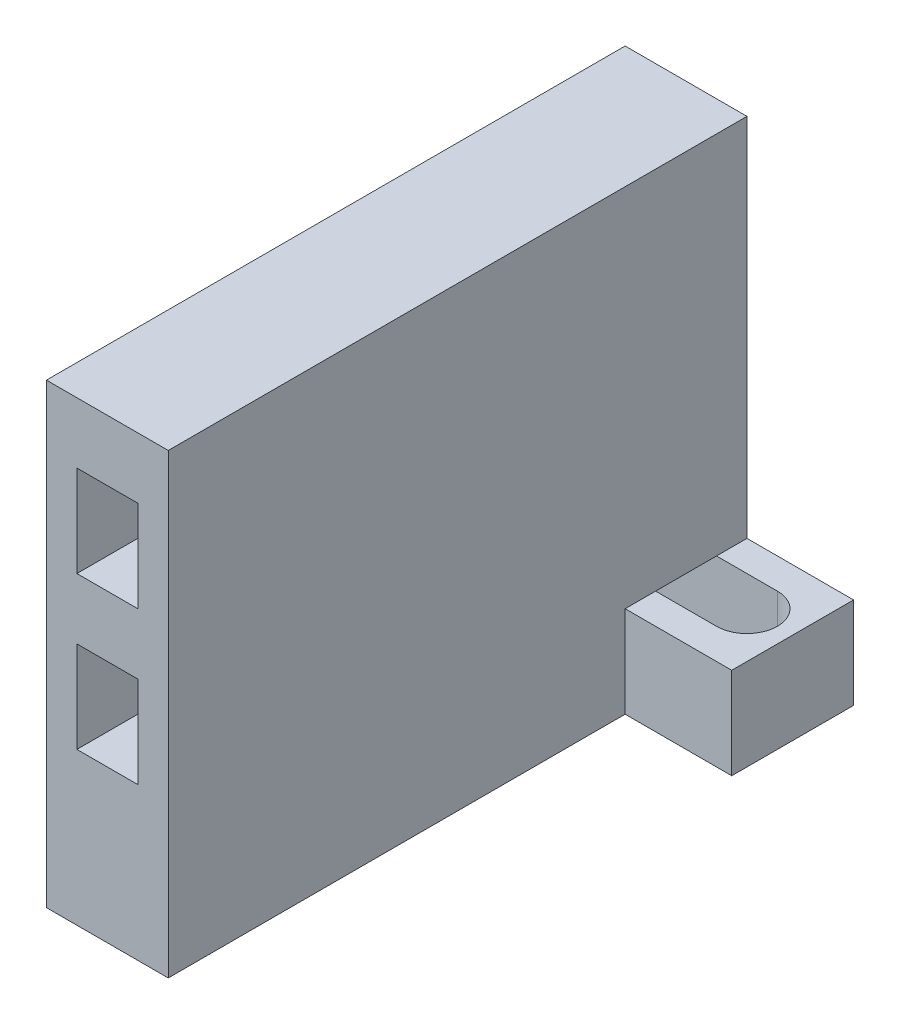
ISO-10303-21;
HEADER;
FILE_DESCRIPTION(('STEP AP214'),'2;1');
FILE_NAME('part.step','',(''),(''),'','','');
FILE_SCHEMA(('AUTOMOTIVE_DESIGN { 1 0 10303 214 1 1 1 1 }'));
ENDSEC;
DATA;
#1=APPLICATION_CONTEXT('core data for automotive mechanical design processes');
#2=APPLICATION_PROTOCOL_DEFINITION('international standard','automotive_design',2000,#1);
#3=PRODUCT_CONTEXT('',#1,'mechanical');
#4=PRODUCT('Part','Part','',(#3));
#5=PRODUCT_RELATED_PRODUCT_CATEGORY('part','',(#4));
#6=PRODUCT_DEFINITION_FORMATION('','',#4);
#7=PRODUCT_DEFINITION_CONTEXT('part definition',#1,'design');
#8=PRODUCT_DEFINITION('design','',#6,#7);
#9=PRODUCT_DEFINITION_SHAPE('','',#8);
#10=(LENGTH_UNIT() NAMED_UNIT(*) SI_UNIT(.MILLI.,.METRE.));
#11=(NAMED_UNIT(*) PLANE_ANGLE_UNIT() SI_UNIT($,.RADIAN.));
#12=(NAMED_UNIT(*) SI_UNIT($,.STERADIAN.) SOLID_ANGLE_UNIT());
#13=UNCERTAINTY_MEASURE_WITH_UNIT(LENGTH_MEASURE(1.E-05),#10,'distance_accuracy_value','');
#14=(GEOMETRIC_REPRESENTATION_CONTEXT(3) GLOBAL_UNCERTAINTY_ASSIGNED_CONTEXT((#13)) GLOBAL_UNIT_ASSIGNED_CONTEXT((#10,
#11,#12)) REPRESENTATION_CONTEXT('',''));
#15=CARTESIAN_POINT('',(0.,0.,0.));
#16=DIRECTION('',(0.,0.,1.));
#17=DIRECTION('',(1.,0.,0.));
#18=AXIS2_PLACEMENT_3D('',#15,#16,#17);
#19=CARTESIAN_POINT('',(0.,0.,8.));
#20=DIRECTION('',(0.,0.,1.));
#21=DIRECTION('',(1.,0.,0.));
#22=AXIS2_PLACEMENT_3D('',#19,#20,#21);
#23=PLANE('',#22);
#24=DIRECTION('',(-1.,0.,0.));
#25=VECTOR('',#24,1.);
#26=CARTESIAN_POINT('',(0.,5.99999999999999,8.));
#27=LINE('',#26,#25);
#28=CARTESIAN_POINT('',(15.,6.,8.));
#29=VERTEX_POINT('',#28);
#30=CARTESIAN_POINT('',(8.,6.,8.));
#31=VERTEX_POINT('',#30);
#32=EDGE_CURVE('E298',#29,#31,#27,.T.);
#33=ORIENTED_EDGE('',*,*,#32,.T.);
#34=DIRECTION('',(0.,-1.,0.));
#35=VECTOR('',#34,1.);
#36=CARTESIAN_POINT('',(8.,0.,8.));
#37=LINE('',#36,#35);
#38=CARTESIAN_POINT('',(8.,0.,8.));
#39=VERTEX_POINT('',#38);
#40=EDGE_CURVE('E12',#31,#39,#37,.T.);
#41=ORIENTED_EDGE('',*,*,#40,.T.);
#42=DIRECTION('',(1.,0.,0.));
#43=VECTOR('',#42,1.);
#44=CARTESIAN_POINT('',(0.,0.,8.));
#45=LINE('',#44,#43);
#46=CARTESIAN_POINT('',(15.,0.,8.));
#47=VERTEX_POINT('',#46);
#48=EDGE_CURVE('E301',#39,#47,#45,.T.);
#49=ORIENTED_EDGE('',*,*,#48,.T.);
#50=DIRECTION('',(0.,1.,0.));
#51=VECTOR('',#50,1.);
#52=CARTESIAN_POINT('',(15.,0.,8.));
#53=LINE('',#52,#51);
#54=EDGE_CURVE('E304',#47,#29,#53,.T.);
#55=ORIENTED_EDGE('',*,*,#54,.T.);
#56=EDGE_LOOP('',(#33,#41,#49,#55));
#57=FACE_BOUND('',#56,.T.);
#58=ADVANCED_FACE('F85',(#57),#23,.T.);
#59=CARTESIAN_POINT('',(0.,5.99999999999999,8.));
#60=DIRECTION('',(0.,-1.,0.));
#61=DIRECTION('',(1.,0.,0.));
#62=AXIS2_PLACEMENT_3D('',#59,#60,#61);
#63=PLANE('',#62);
#64=DIRECTION('',(0.,0.,-1.));
#65=VECTOR('',#64,1.);
#66=CARTESIAN_POINT('',(8.,5.99999999999999,8.));
#67=LINE('',#66,#65);
#68=CARTESIAN_POINT('',(8.,5.99999999999999,2.00000000000002));
#69=VERTEX_POINT('',#68);
#70=CARTESIAN_POINT('',(8.,5.99999999999999,0.));
#71=VERTEX_POINT('',#70);
#72=EDGE_CURVE('E358',#69,#71,#67,.T.);
#73=ORIENTED_EDGE('',*,*,#72,.F.);
#74=DIRECTION('',(-1.,0.,0.));
#75=VECTOR('',#74,1.);
#76=CARTESIAN_POINT('',(0.,5.99999999999998,2.00000000000002));
#77=LINE('',#76,#75);
#78=CARTESIAN_POINT('',(12.,6.,2.00000000000002));
#79=VERTEX_POINT('',#78);
#80=EDGE_CURVE('E102',#79,#69,#77,.T.);
#81=ORIENTED_EDGE('',*,*,#80,.F.);
#82=CARTESIAN_POINT('',(12.,6.,4.00000000000002));
#83=DIRECTION('',(0.,-1.,0.));
#84=DIRECTION('',(1.,0.,0.));
#85=AXIS2_PLACEMENT_3D('',#82,#83,#84);
#86=CIRCLE('',#85,2.);
#87=CARTESIAN_POINT('',(12.,6.,6.00000000000005));
#88=VERTEX_POINT('',#87);
#89=EDGE_CURVE('E257',#88,#79,#86,.F.);
#90=ORIENTED_EDGE('',*,*,#89,.F.);
#91=DIRECTION('',(-1.,0.,0.));
#92=VECTOR('',#91,1.);
#93=CARTESIAN_POINT('',(0.,5.99999999999998,6.00000000000004));
#94=LINE('',#93,#92);
#95=CARTESIAN_POINT('',(8.,5.99999999999999,6.00000000000005));
#96=VERTEX_POINT('',#95);
#97=EDGE_CURVE('E233',#88,#96,#94,.T.);
#98=ORIENTED_EDGE('',*,*,#97,.T.);
#99=EDGE_CURVE('E94',#31,#96,#67,.T.);
#100=ORIENTED_EDGE('',*,*,#99,.F.);
#101=ORIENTED_EDGE('',*,*,#32,.F.);
#102=DIRECTION('',(0.,0.,-1.));
#103=VECTOR('',#102,1.);
#104=CARTESIAN_POINT('',(15.,6.,8.));
#105=LINE('',#104,#103);
#106=CARTESIAN_POINT('',(15.,6.,0.));
#107=VERTEX_POINT('',#106);
#108=EDGE_CURVE('E342',#29,#107,#105,.T.);
#109=ORIENTED_EDGE('',*,*,#108,.T.);
#110=DIRECTION('',(-1.,0.,0.));
#111=VECTOR('',#110,1.);
#112=CARTESIAN_POINT('',(0.,5.99999999999999,0.));
#113=LINE('',#112,#111);
#114=EDGE_CURVE('E330',#107,#71,#113,.T.);
#115=ORIENTED_EDGE('',*,*,#114,.T.);
#116=EDGE_LOOP('',(#73,#81,#90,#98,#100,#101,#109,#115));
#117=FACE_BOUND('',#116,.T.);
#118=ADVANCED_FACE('F402',(#117),#63,.F.);
#119=CARTESIAN_POINT('',(8.,0.,8.));
#120=DIRECTION('',(-1.,0.,0.));
#121=DIRECTION('',(0.,-1.,0.));
#122=AXIS2_PLACEMENT_3D('',#119,#120,#121);
#123=PLANE('',#122);
#124=DIRECTION('',(0.,1.,0.));
#125=VECTOR('',#124,1.);
#126=CARTESIAN_POINT('',(8.,0.,0.));
#127=LINE('',#126,#125);
#128=CARTESIAN_POINT('',(8.,30.,0.));
#129=VERTEX_POINT('',#128);
#130=EDGE_CURVE('E333',#71,#129,#127,.T.);
#131=ORIENTED_EDGE('',*,*,#130,.T.);
#132=DIRECTION('',(0.,0.,-1.));
#133=VECTOR('',#132,1.);
#134=CARTESIAN_POINT('',(8.,30.,8.));
#135=LINE('',#134,#133);
#136=CARTESIAN_POINT('',(8.,30.,38.));
#137=VERTEX_POINT('',#136);
#138=EDGE_CURVE('E355',#137,#129,#135,.T.);
#139=ORIENTED_EDGE('',*,*,#138,.F.);
#140=DIRECTION('',(0.,-1.,0.));
#141=VECTOR('',#140,1.);
#142=CARTESIAN_POINT('',(8.,0.,38.));
#143=LINE('',#142,#141);
#144=CARTESIAN_POINT('',(8.,0.,38.));
#145=VERTEX_POINT('',#144);
#146=EDGE_CURVE('E283',#137,#145,#143,.T.);
#147=ORIENTED_EDGE('',*,*,#146,.T.);
#148=DIRECTION('',(0.,0.,-1.));
#149=VECTOR('',#148,1.);
#150=CARTESIAN_POINT('',(8.,0.,38.));
#151=LINE('',#150,#149);
#152=EDGE_CURVE('E294',#145,#39,#151,.T.);
#153=ORIENTED_EDGE('',*,*,#152,.T.);
#154=ORIENTED_EDGE('',*,*,#40,.F.);
#155=ORIENTED_EDGE('',*,*,#99,.T.);
#156=EDGE_CURVE('E361',#96,#69,#67,.T.);
#157=ORIENTED_EDGE('',*,*,#156,.T.);
#158=ORIENTED_EDGE('',*,*,#72,.T.);
#159=EDGE_LOOP('',(#131,#139,#147,#153,#154,#155,#157,#158));
#160=FACE_BOUND('',#159,.T.);
#161=ADVANCED_FACE('F408',(#160),#123,.F.);
#162=CARTESIAN_POINT('',(0.,30.,8.));
#163=DIRECTION('',(0.,-1.,0.));
#164=DIRECTION('',(0.,0.,-1.));
#165=AXIS2_PLACEMENT_3D('',#162,#163,#164);
#166=PLANE('',#165);
#167=DIRECTION('',(-1.,0.,0.));
#168=VECTOR('',#167,1.);
#169=CARTESIAN_POINT('',(0.,30.,0.));
#170=LINE('',#169,#168);
#171=CARTESIAN_POINT('',(0.,30.,0.));
#172=VERTEX_POINT('',#171);
#173=EDGE_CURVE('E335',#129,#172,#170,.T.);
#174=ORIENTED_EDGE('',*,*,#173,.T.);
#175=DIRECTION('',(0.,0.,-1.));
#176=VECTOR('',#175,1.);
#177=CARTESIAN_POINT('',(0.,30.,8.));
#178=LINE('',#177,#176);
#179=CARTESIAN_POINT('',(0.,30.,38.));
#180=VERTEX_POINT('',#179);
#181=EDGE_CURVE('E352',#180,#172,#178,.T.);
#182=ORIENTED_EDGE('',*,*,#181,.F.);
#183=DIRECTION('',(1.,0.,0.));
#184=VECTOR('',#183,1.);
#185=CARTESIAN_POINT('',(0.,30.,38.));
#186=LINE('',#185,#184);
#187=EDGE_CURVE('E292',#180,#137,#186,.T.);
#188=ORIENTED_EDGE('',*,*,#187,.T.);
#189=ORIENTED_EDGE('',*,*,#138,.T.);
#190=EDGE_LOOP('',(#174,#182,#188,#189));
#191=FACE_BOUND('',#190,.T.);
#192=ADVANCED_FACE('F427',(#191),#166,.F.);
#193=CARTESIAN_POINT('',(0.,0.,8.));
#194=DIRECTION('',(1.,0.,0.));
#195=DIRECTION('',(0.,0.,-1.));
#196=AXIS2_PLACEMENT_3D('',#193,#194,#195);
#197=PLANE('',#196);
#198=DIRECTION('',(0.,-1.,0.));
#199=VECTOR('',#198,1.);
#200=CARTESIAN_POINT('',(0.,0.,0.));
#201=LINE('',#200,#199);
#202=CARTESIAN_POINT('',(0.,0.,0.));
#203=VERTEX_POINT('',#202);
#204=EDGE_CURVE('E337',#172,#203,#201,.T.);
#205=ORIENTED_EDGE('',*,*,#204,.T.);
#206=DIRECTION('',(0.,0.,-1.));
#207=VECTOR('',#206,1.);
#208=CARTESIAN_POINT('',(0.,0.,8.));
#209=LINE('',#208,#207);
#210=CARTESIAN_POINT('',(0.,0.,38.));
#211=VERTEX_POINT('',#210);
#212=EDGE_CURVE('E349',#211,#203,#209,.T.);
#213=ORIENTED_EDGE('',*,*,#212,.F.);
#214=DIRECTION('',(0.,1.,0.));
#215=VECTOR('',#214,1.);
#216=CARTESIAN_POINT('',(0.,0.,38.));
#217=LINE('',#216,#215);
#218=EDGE_CURVE('E289',#211,#180,#217,.T.);
#219=ORIENTED_EDGE('',*,*,#218,.T.);
#220=ORIENTED_EDGE('',*,*,#181,.T.);
#221=EDGE_LOOP('',(#205,#213,#219,#220));
#222=FACE_BOUND('',#221,.T.);
#223=ADVANCED_FACE('F424',(#222),#197,.F.);
#224=CARTESIAN_POINT('',(0.,0.,8.));
#225=DIRECTION('',(0.,1.,0.));
#226=DIRECTION('',(0.,0.,1.));
#227=AXIS2_PLACEMENT_3D('',#224,#225,#226);
#228=PLANE('',#227);
#229=CARTESIAN_POINT('',(12.,0.,4.00000000000002));
#230=DIRECTION('',(0.,-1.,0.));
#231=DIRECTION('',(0.,0.,-1.00000000000001));
#232=AXIS2_PLACEMENT_3D('',#229,#230,#231);
#233=CIRCLE('',#232,2.);
#234=CARTESIAN_POINT('',(12.,0.,2.00000000000002));
#235=VERTEX_POINT('',#234);
#236=CARTESIAN_POINT('',(12.,0.,6.00000000000005));
#237=VERTEX_POINT('',#236);
#238=EDGE_CURVE('E240',#235,#237,#233,.T.);
#239=ORIENTED_EDGE('',*,*,#238,.F.);
#240=DIRECTION('',(1.,0.,0.));
#241=VECTOR('',#240,1.);
#242=CARTESIAN_POINT('',(0.,0.,2.00000000000002));
#243=LINE('',#242,#241);
#244=CARTESIAN_POINT('',(4.,0.,2.00000000000002));
#245=VERTEX_POINT('',#244);
#246=EDGE_CURVE('E108',#245,#235,#243,.T.);
#247=ORIENTED_EDGE('',*,*,#246,.F.);
#248=CARTESIAN_POINT('',(4.,0.,4.00000000000002));
#249=DIRECTION('',(0.,-1.,0.));
#250=DIRECTION('',(0.,0.,-1.00000000000001));
#251=AXIS2_PLACEMENT_3D('',#248,#249,#250);
#252=CIRCLE('',#251,2.);
#253=CARTESIAN_POINT('',(4.,0.,6.00000000000005));
#254=VERTEX_POINT('',#253);
#255=EDGE_CURVE('E247',#254,#245,#252,.T.);
#256=ORIENTED_EDGE('',*,*,#255,.F.);
#257=DIRECTION('',(1.,0.,0.));
#258=VECTOR('',#257,1.);
#259=CARTESIAN_POINT('',(0.,0.,6.00000000000004));
#260=LINE('',#259,#258);
#261=EDGE_CURVE('E229',#254,#237,#260,.T.);
#262=ORIENTED_EDGE('',*,*,#261,.T.);
#263=EDGE_LOOP('',(#239,#247,#256,#262));
#264=FACE_BOUND('',#263,.T.);
#265=DIRECTION('',(1.,0.,0.));
#266=VECTOR('',#265,1.);
#267=CARTESIAN_POINT('',(0.,0.,0.));
#268=LINE('',#267,#266);
#269=CARTESIAN_POINT('',(15.,0.,0.));
#270=VERTEX_POINT('',#269);
#271=EDGE_CURVE('E339',#203,#270,#268,.T.);
#272=ORIENTED_EDGE('',*,*,#271,.T.);
#273=DIRECTION('',(0.,0.,-1.));
#274=VECTOR('',#273,1.);
#275=CARTESIAN_POINT('',(15.,0.,8.));
#276=LINE('',#275,#274);
#277=EDGE_CURVE('E345',#47,#270,#276,.T.);
#278=ORIENTED_EDGE('',*,*,#277,.F.);
#279=ORIENTED_EDGE('',*,*,#48,.F.);
#280=ORIENTED_EDGE('',*,*,#152,.F.);
#281=DIRECTION('',(-1.,0.,0.));
#282=VECTOR('',#281,1.);
#283=CARTESIAN_POINT('',(0.,0.,38.));
#284=LINE('',#283,#282);
#285=EDGE_CURVE('E286',#145,#211,#284,.T.);
#286=ORIENTED_EDGE('',*,*,#285,.T.);
#287=ORIENTED_EDGE('',*,*,#212,.T.);
#288=EDGE_LOOP('',(#272,#278,#279,#280,#286,#287));
#289=FACE_BOUND('',#288,.T.);
#290=ADVANCED_FACE('F244',(#264,#289),#228,.F.);
#291=CARTESIAN_POINT('',(2.,0.,8.));
#292=DIRECTION('',(1.,0.,0.));
#293=DIRECTION('',(0.,1.,0.));
#294=AXIS2_PLACEMENT_3D('',#291,#292,#293);
#295=PLANE('',#294);
#296=DIRECTION('',(0.,-1.,0.));
#297=VECTOR('',#296,1.);
#298=CARTESIAN_POINT('',(2.,0.,0.));
#299=LINE('',#298,#297);
#300=CARTESIAN_POINT('',(2.,16.,0.));
#301=VERTEX_POINT('',#300);
#302=CARTESIAN_POINT('',(2.,10.,0.));
#303=VERTEX_POINT('',#302);
#304=EDGE_CURVE('E318',#301,#303,#299,.T.);
#305=ORIENTED_EDGE('',*,*,#304,.F.);
#306=DIRECTION('',(0.,0.,-1.));
#307=VECTOR('',#306,1.);
#308=CARTESIAN_POINT('',(2.,16.,8.));
#309=LINE('',#308,#307);
#310=CARTESIAN_POINT('',(2.,16.,38.));
#311=VERTEX_POINT('',#310);
#312=EDGE_CURVE('E346',#311,#301,#309,.T.);
#313=ORIENTED_EDGE('',*,*,#312,.F.);
#314=DIRECTION('',(0.,1.,0.));
#315=VECTOR('',#314,1.);
#316=CARTESIAN_POINT('',(2.,0.,38.));
#317=LINE('',#316,#315);
#318=CARTESIAN_POINT('',(2.,10.,38.));
#319=VERTEX_POINT('',#318);
#320=EDGE_CURVE('E277',#319,#311,#317,.T.);
#321=ORIENTED_EDGE('',*,*,#320,.F.);
#322=DIRECTION('',(0.,0.,-1.));
#323=VECTOR('',#322,1.);
#324=CARTESIAN_POINT('',(2.,10.,8.));
#325=LINE('',#324,#323);
#326=EDGE_CURVE('E362',#319,#303,#325,.T.);
#327=ORIENTED_EDGE('',*,*,#326,.T.);
#328=EDGE_LOOP('',(#305,#313,#321,#327));
#329=FACE_BOUND('',#328,.T.);
#330=ADVANCED_FACE('F423',(#329),#295,.T.);
#331=CARTESIAN_POINT('',(0.,16.,8.));
#332=DIRECTION('',(0.,1.,0.));
#333=DIRECTION('',(0.,0.,1.));
#334=AXIS2_PLACEMENT_3D('',#331,#332,#333);
#335=PLANE('',#334);
#336=DIRECTION('',(1.,0.,0.));
#337=VECTOR('',#336,1.);
#338=CARTESIAN_POINT('',(0.,16.,0.));
#339=LINE('',#338,#337);
#340=CARTESIAN_POINT('',(6.,16.,0.));
#341=VERTEX_POINT('',#340);
#342=EDGE_CURVE('E321',#301,#341,#339,.T.);
#343=ORIENTED_EDGE('',*,*,#342,.T.);
#344=DIRECTION('',(0.,0.,-1.));
#345=VECTOR('',#344,1.);
#346=CARTESIAN_POINT('',(6.,16.,8.));
#347=LINE('',#346,#345);
#348=CARTESIAN_POINT('',(6.,16.,38.));
#349=VERTEX_POINT('',#348);
#350=EDGE_CURVE('E366',#349,#341,#347,.T.);
#351=ORIENTED_EDGE('',*,*,#350,.F.);
#352=DIRECTION('',(-1.,0.,0.));
#353=VECTOR('',#352,1.);
#354=CARTESIAN_POINT('',(0.,16.,38.));
#355=LINE('',#354,#353);
#356=EDGE_CURVE('E274',#349,#311,#355,.T.);
#357=ORIENTED_EDGE('',*,*,#356,.T.);
#358=ORIENTED_EDGE('',*,*,#312,.T.);
#359=EDGE_LOOP('',(#343,#351,#357,#358));
#360=FACE_BOUND('',#359,.T.);
#361=ADVANCED_FACE('F438',(#360),#335,.F.);
#362=CARTESIAN_POINT('',(6.,0.,8.));
#363=DIRECTION('',(1.,0.,0.));
#364=DIRECTION('',(0.,0.,-1.));
#365=AXIS2_PLACEMENT_3D('',#362,#363,#364);
#366=PLANE('',#365);
#367=DIRECTION('',(0.,-1.,0.));
#368=VECTOR('',#367,1.);
#369=CARTESIAN_POINT('',(6.,0.,0.));
#370=LINE('',#369,#368);
#371=CARTESIAN_POINT('',(6.,10.,0.));
#372=VERTEX_POINT('',#371);
#373=EDGE_CURVE('E324',#341,#372,#370,.T.);
#374=ORIENTED_EDGE('',*,*,#373,.T.);
#375=DIRECTION('',(0.,0.,-1.));
#376=VECTOR('',#375,1.);
#377=CARTESIAN_POINT('',(6.,10.,8.));
#378=LINE('',#377,#376);
#379=CARTESIAN_POINT('',(6.,10.,38.));
#380=VERTEX_POINT('',#379);
#381=EDGE_CURVE('E364',#380,#372,#378,.T.);
#382=ORIENTED_EDGE('',*,*,#381,.F.);
#383=DIRECTION('',(0.,1.,0.));
#384=VECTOR('',#383,1.);
#385=CARTESIAN_POINT('',(6.,0.,38.));
#386=LINE('',#385,#384);
#387=EDGE_CURVE('E271',#380,#349,#386,.T.);
#388=ORIENTED_EDGE('',*,*,#387,.T.);
#389=ORIENTED_EDGE('',*,*,#350,.T.);
#390=EDGE_LOOP('',(#374,#382,#388,#389));
#391=FACE_BOUND('',#390,.T.);
#392=ADVANCED_FACE('F435',(#391),#366,.F.);
#393=CARTESIAN_POINT('',(2.,0.,8.));
#394=DIRECTION('',(-1.,0.,0.));
#395=DIRECTION('',(0.,-1.,0.));
#396=AXIS2_PLACEMENT_3D('',#393,#394,#395);
#397=PLANE('',#396);
#398=DIRECTION('',(0.,1.,0.));
#399=VECTOR('',#398,1.);
#400=CARTESIAN_POINT('',(2.,0.,0.));
#401=LINE('',#400,#399);
#402=CARTESIAN_POINT('',(2.,20.,0.));
#403=VERTEX_POINT('',#402);
#404=CARTESIAN_POINT('',(2.,26.,0.));
#405=VERTEX_POINT('',#404);
#406=EDGE_CURVE('E297',#403,#405,#401,.T.);
#407=ORIENTED_EDGE('',*,*,#406,.T.);
#408=DIRECTION('',(0.,0.,-1.));
#409=VECTOR('',#408,1.);
#410=CARTESIAN_POINT('',(2.,26.,8.));
#411=LINE('',#410,#409);
#412=CARTESIAN_POINT('',(2.,26.,38.));
#413=VERTEX_POINT('',#412);
#414=EDGE_CURVE('E89',#413,#405,#411,.T.);
#415=ORIENTED_EDGE('',*,*,#414,.F.);
#416=DIRECTION('',(0.,-1.,0.));
#417=VECTOR('',#416,1.);
#418=CARTESIAN_POINT('',(2.,0.,38.));
#419=LINE('',#418,#417);
#420=CARTESIAN_POINT('',(2.,20.,38.));
#421=VERTEX_POINT('',#420);
#422=EDGE_CURVE('E262',#413,#421,#419,.T.);
#423=ORIENTED_EDGE('',*,*,#422,.T.);
#424=DIRECTION('',(0.,0.,-1.));
#425=VECTOR('',#424,1.);
#426=CARTESIAN_POINT('',(2.,20.,8.));
#427=LINE('',#426,#425);
#428=EDGE_CURVE('E306',#421,#403,#427,.T.);
#429=ORIENTED_EDGE('',*,*,#428,.T.);
#430=EDGE_LOOP('',(#407,#415,#423,#429));
#431=FACE_BOUND('',#430,.T.);
#432=ADVANCED_FACE('F87',(#431),#397,.F.);
#433=CARTESIAN_POINT('',(0.,26.,8.));
#434=DIRECTION('',(0.,1.,0.));
#435=DIRECTION('',(-1.,0.,0.));
#436=AXIS2_PLACEMENT_3D('',#433,#434,#435);
#437=PLANE('',#436);
#438=DIRECTION('',(1.,0.,0.));
#439=VECTOR('',#438,1.);
#440=CARTESIAN_POINT('',(0.,26.,0.));
#441=LINE('',#440,#439);
#442=CARTESIAN_POINT('',(6.,26.,0.));
#443=VERTEX_POINT('',#442);
#444=EDGE_CURVE('E309',#405,#443,#441,.T.);
#445=ORIENTED_EDGE('',*,*,#444,.T.);
#446=DIRECTION('',(0.,0.,-1.));
#447=VECTOR('',#446,1.);
#448=CARTESIAN_POINT('',(6.,26.,8.));
#449=LINE('',#448,#447);
#450=CARTESIAN_POINT('',(6.,26.,38.));
#451=VERTEX_POINT('',#450);
#452=EDGE_CURVE('E372',#451,#443,#449,.T.);
#453=ORIENTED_EDGE('',*,*,#452,.F.);
#454=DIRECTION('',(-1.,0.,0.));
#455=VECTOR('',#454,1.);
#456=CARTESIAN_POINT('',(0.,26.,38.));
#457=LINE('',#456,#455);
#458=EDGE_CURVE('E265',#451,#413,#457,.T.);
#459=ORIENTED_EDGE('',*,*,#458,.T.);
#460=ORIENTED_EDGE('',*,*,#414,.T.);
#461=EDGE_LOOP('',(#445,#453,#459,#460));
#462=FACE_BOUND('',#461,.T.);
#463=ADVANCED_FACE('F378',(#462),#437,.F.);
#464=CARTESIAN_POINT('',(6.00000000000002,0.,8.));
#465=DIRECTION('',(-1.,0.,0.));
#466=DIRECTION('',(0.,-1.,0.));
#467=AXIS2_PLACEMENT_3D('',#464,#465,#466);
#468=PLANE('',#467);
#469=DIRECTION('',(0.,1.,0.));
#470=VECTOR('',#469,1.);
#471=CARTESIAN_POINT('',(6.00000000000002,0.,0.));
#472=LINE('',#471,#470);
#473=CARTESIAN_POINT('',(6.,20.,0.));
#474=VERTEX_POINT('',#473);
#475=EDGE_CURVE('E312',#474,#443,#472,.T.);
#476=ORIENTED_EDGE('',*,*,#475,.F.);
#477=DIRECTION('',(0.,0.,-1.));
#478=VECTOR('',#477,1.);
#479=CARTESIAN_POINT('',(6.,20.,8.));
#480=LINE('',#479,#478);
#481=CARTESIAN_POINT('',(6.,20.,38.));
#482=VERTEX_POINT('',#481);
#483=EDGE_CURVE('E371',#482,#474,#480,.T.);
#484=ORIENTED_EDGE('',*,*,#483,.F.);
#485=DIRECTION('',(0.,-1.,0.));
#486=VECTOR('',#485,1.);
#487=CARTESIAN_POINT('',(6.00000000000002,0.,38.));
#488=LINE('',#487,#486);
#489=EDGE_CURVE('E268',#451,#482,#488,.T.);
#490=ORIENTED_EDGE('',*,*,#489,.F.);
#491=ORIENTED_EDGE('',*,*,#452,.T.);
#492=EDGE_LOOP('',(#476,#484,#490,#491));
#493=FACE_BOUND('',#492,.T.);
#494=ADVANCED_FACE('F390',(#493),#468,.T.);
#495=CARTESIAN_POINT('',(0.,10.,8.));
#496=DIRECTION('',(0.,1.,0.));
#497=DIRECTION('',(0.,0.,1.));
#498=AXIS2_PLACEMENT_3D('',#495,#496,#497);
#499=PLANE('',#498);
#500=DIRECTION('',(1.,0.,0.));
#501=VECTOR('',#500,1.);
#502=CARTESIAN_POINT('',(0.,10.,0.));
#503=LINE('',#502,#501);
#504=EDGE_CURVE('E327',#303,#372,#503,.T.);
#505=ORIENTED_EDGE('',*,*,#504,.F.);
#506=ORIENTED_EDGE('',*,*,#326,.F.);
#507=DIRECTION('',(-1.,0.,0.));
#508=VECTOR('',#507,1.);
#509=CARTESIAN_POINT('',(0.,10.,38.));
#510=LINE('',#509,#508);
#511=EDGE_CURVE('E280',#380,#319,#510,.T.);
#512=ORIENTED_EDGE('',*,*,#511,.F.);
#513=ORIENTED_EDGE('',*,*,#381,.T.);
#514=EDGE_LOOP('',(#505,#506,#512,#513));
#515=FACE_BOUND('',#514,.T.);
#516=ADVANCED_FACE('F392',(#515),#499,.T.);
#517=CARTESIAN_POINT('',(0.,20.,8.));
#518=DIRECTION('',(0.,1.,0.));
#519=DIRECTION('',(0.,0.,1.));
#520=AXIS2_PLACEMENT_3D('',#517,#518,#519);
#521=PLANE('',#520);
#522=DIRECTION('',(1.,0.,0.));
#523=VECTOR('',#522,1.);
#524=CARTESIAN_POINT('',(0.,20.,0.));
#525=LINE('',#524,#523);
#526=EDGE_CURVE('E315',#403,#474,#525,.T.);
#527=ORIENTED_EDGE('',*,*,#526,.F.);
#528=ORIENTED_EDGE('',*,*,#428,.F.);
#529=DIRECTION('',(-1.,0.,0.));
#530=VECTOR('',#529,1.);
#531=CARTESIAN_POINT('',(0.,20.,38.));
#532=LINE('',#531,#530);
#533=EDGE_CURVE('E259',#482,#421,#532,.T.);
#534=ORIENTED_EDGE('',*,*,#533,.F.);
#535=ORIENTED_EDGE('',*,*,#483,.T.);
#536=EDGE_LOOP('',(#527,#528,#534,#535));
#537=FACE_BOUND('',#536,.T.);
#538=ADVANCED_FACE('F388',(#537),#521,.T.);
#539=CARTESIAN_POINT('',(15.,0.,8.));
#540=DIRECTION('',(-1.,0.,0.));
#541=DIRECTION('',(0.,-1.,0.));
#542=AXIS2_PLACEMENT_3D('',#539,#540,#541);
#543=PLANE('',#542);
#544=DIRECTION('',(0.,1.,0.));
#545=VECTOR('',#544,1.);
#546=CARTESIAN_POINT('',(15.,0.,0.));
#547=LINE('',#546,#545);
#548=EDGE_CURVE('E302',#270,#107,#547,.T.);
#549=ORIENTED_EDGE('',*,*,#548,.T.);
#550=ORIENTED_EDGE('',*,*,#108,.F.);
#551=ORIENTED_EDGE('',*,*,#54,.F.);
#552=ORIENTED_EDGE('',*,*,#277,.T.);
#553=EDGE_LOOP('',(#549,#550,#551,#552));
#554=FACE_BOUND('',#553,.T.);
#555=ADVANCED_FACE('F417',(#554),#543,.F.);
#556=CARTESIAN_POINT('',(0.,0.,0.));
#557=DIRECTION('',(0.,0.,1.));
#558=DIRECTION('',(1.,0.,0.));
#559=AXIS2_PLACEMENT_3D('',#556,#557,#558);
#560=PLANE('',#559);
#561=ORIENTED_EDGE('',*,*,#406,.F.);
#562=ORIENTED_EDGE('',*,*,#526,.T.);
#563=ORIENTED_EDGE('',*,*,#475,.T.);
#564=ORIENTED_EDGE('',*,*,#444,.F.);
#565=EDGE_LOOP('',(#561,#562,#563,#564));
#566=FACE_BOUND('',#565,.T.);
#567=ORIENTED_EDGE('',*,*,#304,.T.);
#568=ORIENTED_EDGE('',*,*,#504,.T.);
#569=ORIENTED_EDGE('',*,*,#373,.F.);
#570=ORIENTED_EDGE('',*,*,#342,.F.);
#571=EDGE_LOOP('',(#567,#568,#569,#570));
#572=FACE_BOUND('',#571,.T.);
#573=ORIENTED_EDGE('',*,*,#114,.F.);
#574=ORIENTED_EDGE('',*,*,#548,.F.);
#575=ORIENTED_EDGE('',*,*,#271,.F.);
#576=ORIENTED_EDGE('',*,*,#204,.F.);
#577=ORIENTED_EDGE('',*,*,#173,.F.);
#578=ORIENTED_EDGE('',*,*,#130,.F.);
#579=EDGE_LOOP('',(#573,#574,#575,#576,#577,#578));
#580=FACE_BOUND('',#579,.T.);
#581=ADVANCED_FACE('F385',(#566,#572,#580),#560,.F.);
#582=CARTESIAN_POINT('',(0.,0.,38.));
#583=DIRECTION('',(0.,0.,-1.));
#584=DIRECTION('',(-1.,0.,0.));
#585=AXIS2_PLACEMENT_3D('',#582,#583,#584);
#586=PLANE('',#585);
#587=ORIENTED_EDGE('',*,*,#489,.T.);
#588=ORIENTED_EDGE('',*,*,#533,.T.);
#589=ORIENTED_EDGE('',*,*,#422,.F.);
#590=ORIENTED_EDGE('',*,*,#458,.F.);
#591=EDGE_LOOP('',(#587,#588,#589,#590));
#592=FACE_BOUND('',#591,.T.);
#593=ORIENTED_EDGE('',*,*,#146,.F.);
#594=ORIENTED_EDGE('',*,*,#187,.F.);
#595=ORIENTED_EDGE('',*,*,#218,.F.);
#596=ORIENTED_EDGE('',*,*,#285,.F.);
#597=EDGE_LOOP('',(#593,#594,#595,#596));
#598=FACE_BOUND('',#597,.T.);
#599=ORIENTED_EDGE('',*,*,#387,.F.);
#600=ORIENTED_EDGE('',*,*,#511,.T.);
#601=ORIENTED_EDGE('',*,*,#320,.T.);
#602=ORIENTED_EDGE('',*,*,#356,.F.);
#603=EDGE_LOOP('',(#599,#600,#601,#602));
#604=FACE_BOUND('',#603,.T.);
#605=ADVANCED_FACE('F413',(#592,#598,#604),#586,.F.);
#606=CARTESIAN_POINT('',(0.,5.99999999999999,8.));
#607=DIRECTION('',(0.,-1.,0.));
#608=DIRECTION('',(1.,0.,0.));
#609=AXIS2_PLACEMENT_3D('',#606,#607,#608);
#610=PLANE('',#609);
#611=ORIENTED_EDGE('',*,*,#156,.F.);
#612=CARTESIAN_POINT('',(4.,5.99999999999999,6.00000000000004));
#613=VERTEX_POINT('',#612);
#614=EDGE_CURVE('E254',#96,#613,#94,.T.);
#615=ORIENTED_EDGE('',*,*,#614,.T.);
#616=CARTESIAN_POINT('',(4.,5.99999999999999,4.00000000000002));
#617=DIRECTION('',(0.,-1.,0.));
#618=DIRECTION('',(1.,0.,0.));
#619=AXIS2_PLACEMENT_3D('',#616,#617,#618);
#620=CIRCLE('',#619,2.);
#621=CARTESIAN_POINT('',(4.,5.99999999999999,2.00000000000002));
#622=VERTEX_POINT('',#621);
#623=EDGE_CURVE('E663',#622,#613,#620,.F.);
#624=ORIENTED_EDGE('',*,*,#623,.F.);
#625=EDGE_CURVE('E664',#69,#622,#77,.T.);
#626=ORIENTED_EDGE('',*,*,#625,.F.);
#627=EDGE_LOOP('',(#611,#615,#624,#626));
#628=FACE_BOUND('',#627,.T.);
#629=ADVANCED_FACE('F464',(#628),#610,.T.);
#630=CARTESIAN_POINT('',(0.,18.6491106406735,2.00000000000002));
#631=DIRECTION('',(0.,0.,-1.));
#632=DIRECTION('',(-1.,0.,0.));
#633=AXIS2_PLACEMENT_3D('',#630,#631,#632);
#634=PLANE('',#633);
#635=ORIENTED_EDGE('',*,*,#80,.T.);
#636=ORIENTED_EDGE('',*,*,#625,.T.);
#637=DIRECTION('',(0.,-1.,0.));
#638=VECTOR('',#637,1.);
#639=CARTESIAN_POINT('',(4.,18.6491106406735,2.00000000000002));
#640=LINE('',#639,#638);
#641=EDGE_CURVE('E252',#622,#245,#640,.T.);
#642=ORIENTED_EDGE('',*,*,#641,.T.);
#643=ORIENTED_EDGE('',*,*,#246,.T.);
#644=DIRECTION('',(0.,-1.,0.));
#645=VECTOR('',#644,1.);
#646=CARTESIAN_POINT('',(12.,18.6491106406735,2.00000000000002));
#647=LINE('',#646,#645);
#648=EDGE_CURVE('E237',#79,#235,#647,.T.);
#649=ORIENTED_EDGE('',*,*,#648,.F.);
#650=EDGE_LOOP('',(#635,#636,#642,#643,#649));
#651=FACE_BOUND('',#650,.T.);
#652=ADVANCED_FACE('F472',(#651),#634,.F.);
#653=CARTESIAN_POINT('',(4.,18.6491106406735,4.00000000000002));
#654=DIRECTION('',(0.,-1.,0.));
#655=DIRECTION('',(0.,0.,-1.));
#656=AXIS2_PLACEMENT_3D('',#653,#654,#655);
#657=CYLINDRICAL_SURFACE('',#656,2.);
#658=ORIENTED_EDGE('',*,*,#623,.T.);
#659=DIRECTION('',(0.,-1.,0.));
#660=VECTOR('',#659,1.);
#661=CARTESIAN_POINT('',(4.,18.6491106406735,6.00000000000005));
#662=LINE('',#661,#660);
#663=EDGE_CURVE('E236',#613,#254,#662,.T.);
#664=ORIENTED_EDGE('',*,*,#663,.T.);
#665=ORIENTED_EDGE('',*,*,#255,.T.);
#666=ORIENTED_EDGE('',*,*,#641,.F.);
#667=EDGE_LOOP('',(#658,#664,#665,#666));
#668=FACE_BOUND('',#667,.T.);
#669=ADVANCED_FACE('F481',(#668),#657,.F.);
#670=CARTESIAN_POINT('',(0.,18.6491106406735,6.00000000000004));
#671=DIRECTION('',(0.,0.,-1.));
#672=DIRECTION('',(-1.,0.,0.));
#673=AXIS2_PLACEMENT_3D('',#670,#671,#672);
#674=PLANE('',#673);
#675=DIRECTION('',(0.,-1.,0.));
#676=VECTOR('',#675,1.);
#677=CARTESIAN_POINT('',(12.,18.6491106406735,6.00000000000005));
#678=LINE('',#677,#676);
#679=EDGE_CURVE('E224',#88,#237,#678,.T.);
#680=ORIENTED_EDGE('',*,*,#679,.T.);
#681=ORIENTED_EDGE('',*,*,#261,.F.);
#682=ORIENTED_EDGE('',*,*,#663,.F.);
#683=ORIENTED_EDGE('',*,*,#614,.F.);
#684=ORIENTED_EDGE('',*,*,#97,.F.);
#685=EDGE_LOOP('',(#680,#681,#682,#683,#684));
#686=FACE_BOUND('',#685,.T.);
#687=ADVANCED_FACE('F226',(#686),#674,.T.);
#688=CARTESIAN_POINT('',(12.,18.6491106406735,4.00000000000002));
#689=DIRECTION('',(0.,-1.,0.));
#690=DIRECTION('',(0.,0.,-1.));
#691=AXIS2_PLACEMENT_3D('',#688,#689,#690);
#692=CYLINDRICAL_SURFACE('',#691,2.);
#693=ORIENTED_EDGE('',*,*,#89,.T.);
#694=ORIENTED_EDGE('',*,*,#648,.T.);
#695=ORIENTED_EDGE('',*,*,#238,.T.);
#696=ORIENTED_EDGE('',*,*,#679,.F.);
#697=EDGE_LOOP('',(#693,#694,#695,#696));
#698=FACE_BOUND('',#697,.T.);
#699=ADVANCED_FACE('F241',(#698),#692,.F.);
#700=CLOSED_SHELL('',(#58,#118,#161,#192,#223,#290,#330,#361,#392,#432,#463,#494,#516,#538,#555,
#581,#605,#629,#652,#669,#687,#699));
#701=MANIFOLD_SOLID_BREP('B2',#700);
#702=ADVANCED_BREP_SHAPE_REPRESENTATION('',(#18,#701),#14);
#703=SHAPE_DEFINITION_REPRESENTATION(#9,#702);
ENDSEC;
END-ISO-10303-21;
